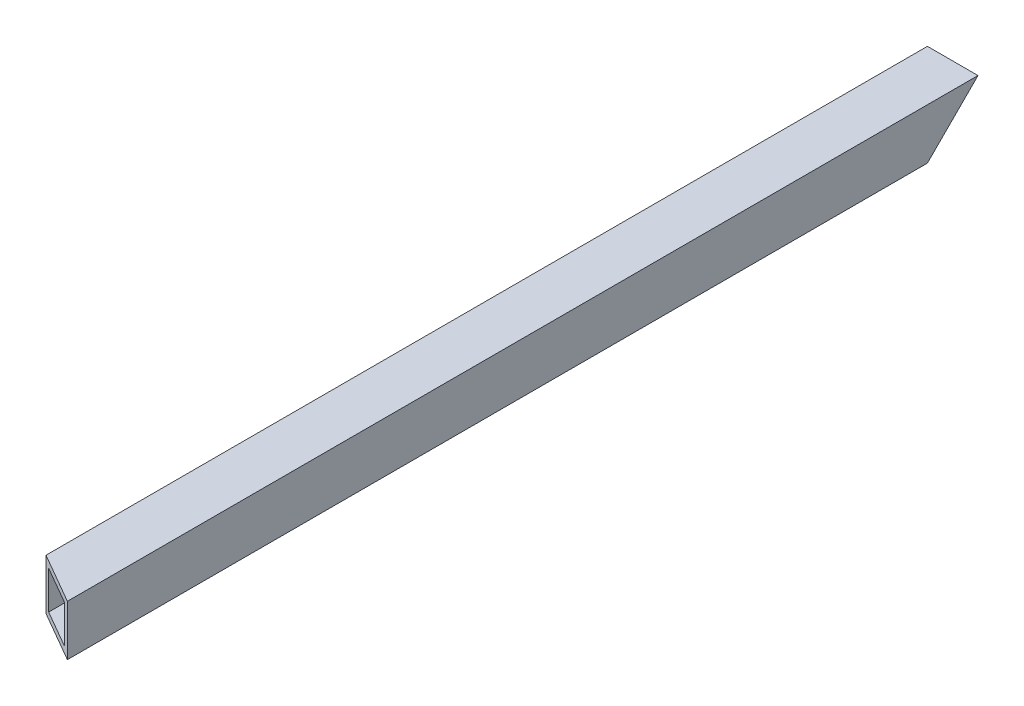
ISO-10303-21;
HEADER;
FILE_DESCRIPTION(('STEP AP214'),'2;1');
FILE_NAME('part.step','',(''),(''),'','','');
FILE_SCHEMA(('AUTOMOTIVE_DESIGN { 1 0 10303 214 1 1 1 1 }'));
ENDSEC;
DATA;
#1=APPLICATION_CONTEXT('core data for automotive mechanical design processes');
#2=APPLICATION_PROTOCOL_DEFINITION('international standard','automotive_design',2000,#1);
#3=PRODUCT_CONTEXT('',#1,'mechanical');
#4=PRODUCT('Part','Part','',(#3));
#5=PRODUCT_RELATED_PRODUCT_CATEGORY('part','',(#4));
#6=PRODUCT_DEFINITION_FORMATION('','',#4);
#7=PRODUCT_DEFINITION_CONTEXT('part definition',#1,'design');
#8=PRODUCT_DEFINITION('design','',#6,#7);
#9=PRODUCT_DEFINITION_SHAPE('','',#8);
#10=(LENGTH_UNIT() NAMED_UNIT(*) SI_UNIT(.MILLI.,.METRE.));
#11=(NAMED_UNIT(*) PLANE_ANGLE_UNIT() SI_UNIT($,.RADIAN.));
#12=(NAMED_UNIT(*) SI_UNIT($,.STERADIAN.) SOLID_ANGLE_UNIT());
#13=UNCERTAINTY_MEASURE_WITH_UNIT(LENGTH_MEASURE(1.E-05),#10,'distance_accuracy_value','');
#14=(GEOMETRIC_REPRESENTATION_CONTEXT(3) GLOBAL_UNCERTAINTY_ASSIGNED_CONTEXT((#13)) GLOBAL_UNIT_ASSIGNED_CONTEXT((#10,
#11,#12)) REPRESENTATION_CONTEXT('',''));
#15=CARTESIAN_POINT('',(0.,0.,0.));
#16=DIRECTION('',(0.,0.,1.));
#17=DIRECTION('',(1.,0.,0.));
#18=AXIS2_PLACEMENT_3D('',#15,#16,#17);
#19=CARTESIAN_POINT('',(-12.7,12.7,213.935303162583));
#20=DIRECTION('',(0.500000000000001,0.,-0.866025403784438));
#21=DIRECTION('',(-0.866025403784438,0.,-0.500000000000001));
#22=AXIS2_PLACEMENT_3D('',#19,#20,#21);
#23=PLANE('',#22);
#24=DIRECTION('',(0.866025403784438,0.,0.500000000000001));
#25=VECTOR('',#24,1.);
#26=CARTESIAN_POINT('',(-49.4933518262807,-12.7,192.692651581292));
#27=LINE('',#26,#25);
#28=CARTESIAN_POINT('',(-12.7,-12.7,213.935303162583));
#29=VERTEX_POINT('',#28);
#30=CARTESIAN_POINT('',(12.7,-12.7,228.6));
#31=VERTEX_POINT('',#30);
#32=EDGE_CURVE('E10',#29,#31,#27,.T.);
#33=ORIENTED_EDGE('',*,*,#32,.T.);
#34=DIRECTION('',(0.,1.,0.));
#35=VECTOR('',#34,1.);
#36=CARTESIAN_POINT('',(12.7,12.7,228.6));
#37=LINE('',#36,#35);
#38=CARTESIAN_POINT('',(12.7,12.7,228.6));
#39=VERTEX_POINT('',#38);
#40=EDGE_CURVE('E26',#31,#39,#37,.T.);
#41=ORIENTED_EDGE('',*,*,#40,.T.);
#42=DIRECTION('',(-0.866025403784438,0.,-0.500000000000001));
#43=VECTOR('',#42,1.);
#44=CARTESIAN_POINT('',(-59.0183518262807,12.7,187.193390267261));
#45=LINE('',#44,#43);
#46=CARTESIAN_POINT('',(-12.7,12.7,213.935303162583));
#47=VERTEX_POINT('',#46);
#48=EDGE_CURVE('E144',#39,#47,#45,.T.);
#49=ORIENTED_EDGE('',*,*,#48,.T.);
#50=DIRECTION('',(0.,-1.,0.));
#51=VECTOR('',#50,1.);
#52=CARTESIAN_POINT('',(-12.7,0.,213.935303162584));
#53=LINE('',#52,#51);
#54=EDGE_CURVE('E141',#47,#29,#53,.T.);
#55=ORIENTED_EDGE('',*,*,#54,.T.);
#56=EDGE_LOOP('',(#33,#41,#49,#55));
#57=FACE_BOUND('',#56,.T.);
#58=DIRECTION('',(0.,1.,0.));
#59=VECTOR('',#58,1.);
#60=CARTESIAN_POINT('',(-9.52500000000001,1.5875,215.768390267261));
#61=LINE('',#60,#59);
#62=CARTESIAN_POINT('',(-9.525,-9.525,215.768390267261));
#63=VERTEX_POINT('',#62);
#64=CARTESIAN_POINT('',(-9.525,9.525,215.768390267261));
#65=VERTEX_POINT('',#64);
#66=EDGE_CURVE('E139',#63,#65,#61,.T.);
#67=ORIENTED_EDGE('',*,*,#66,.T.);
#68=DIRECTION('',(0.866025403784438,0.,0.500000000000001));
#69=VECTOR('',#68,1.);
#70=CARTESIAN_POINT('',(-57.8277268262807,9.525,187.880797931514));
#71=LINE('',#70,#69);
#72=CARTESIAN_POINT('',(9.525,9.525,226.766912895323));
#73=VERTEX_POINT('',#72);
#74=EDGE_CURVE('E105',#65,#73,#71,.T.);
#75=ORIENTED_EDGE('',*,*,#74,.T.);
#76=DIRECTION('',(0.,-1.,0.));
#77=VECTOR('',#76,1.);
#78=CARTESIAN_POINT('',(9.52500000000001,11.1125,226.766912895323));
#79=LINE('',#78,#77);
#80=CARTESIAN_POINT('',(9.525,-9.525,226.766912895323));
#81=VERTEX_POINT('',#80);
#82=EDGE_CURVE('E135',#73,#81,#79,.T.);
#83=ORIENTED_EDGE('',*,*,#82,.T.);
#84=DIRECTION('',(-0.866025403784438,0.,-0.500000000000001));
#85=VECTOR('',#84,1.);
#86=CARTESIAN_POINT('',(-50.6839768262807,-9.525,192.005243917038));
#87=LINE('',#86,#85);
#88=EDGE_CURVE('E132',#81,#63,#87,.T.);
#89=ORIENTED_EDGE('',*,*,#88,.T.);
#90=EDGE_LOOP('',(#67,#75,#83,#89));
#91=FACE_BOUND('',#90,.T.);
#92=ADVANCED_FACE('F16',(#57,#91),#23,.F.);
#93=CARTESIAN_POINT('',(9.525,9.525,0.));
#94=DIRECTION('',(1.,0.,0.));
#95=DIRECTION('',(0.,0.,-1.));
#96=AXIS2_PLACEMENT_3D('',#93,#94,#95);
#97=PLANE('',#96);
#98=ORIENTED_EDGE('',*,*,#82,.F.);
#99=DIRECTION('',(0.,0.,1.));
#100=VECTOR('',#99,1.);
#101=CARTESIAN_POINT('',(9.525,9.525,0.));
#102=LINE('',#101,#100);
#103=CARTESIAN_POINT('',(9.525,9.525,-225.425));
#104=VERTEX_POINT('',#103);
#105=EDGE_CURVE('E107',#104,#73,#102,.T.);
#106=ORIENTED_EDGE('',*,*,#105,.F.);
#107=DIRECTION('',(0.,0.707106781186548,-0.707106781186547));
#108=VECTOR('',#107,1.);
#109=CARTESIAN_POINT('',(9.525,-45.24375,-170.65625));
#110=LINE('',#109,#108);
#111=CARTESIAN_POINT('',(9.525,-9.525,-206.375));
#112=VERTEX_POINT('',#111);
#113=EDGE_CURVE('E99',#112,#104,#110,.T.);
#114=ORIENTED_EDGE('',*,*,#113,.F.);
#115=DIRECTION('',(0.,0.,-1.));
#116=VECTOR('',#115,1.);
#117=CARTESIAN_POINT('',(9.525,-9.525,0.));
#118=LINE('',#117,#116);
#119=EDGE_CURVE('E127',#81,#112,#118,.T.);
#120=ORIENTED_EDGE('',*,*,#119,.F.);
#121=EDGE_LOOP('',(#98,#106,#114,#120));
#122=FACE_BOUND('',#121,.T.);
#123=ADVANCED_FACE('F169',(#122),#97,.F.);
#124=CARTESIAN_POINT('',(9.525,-9.525,0.));
#125=DIRECTION('',(0.,-1.,0.));
#126=DIRECTION('',(0.,0.,-1.));
#127=AXIS2_PLACEMENT_3D('',#124,#125,#126);
#128=PLANE('',#127);
#129=ORIENTED_EDGE('',*,*,#88,.F.);
#130=ORIENTED_EDGE('',*,*,#119,.T.);
#131=DIRECTION('',(1.,0.,0.));
#132=VECTOR('',#131,1.);
#133=CARTESIAN_POINT('',(-1.5875,-9.52500000000001,-206.375));
#134=LINE('',#133,#132);
#135=CARTESIAN_POINT('',(-9.525,-9.525,-206.375));
#136=VERTEX_POINT('',#135);
#137=EDGE_CURVE('E95',#136,#112,#134,.T.);
#138=ORIENTED_EDGE('',*,*,#137,.F.);
#139=DIRECTION('',(0.,0.,-1.));
#140=VECTOR('',#139,1.);
#141=CARTESIAN_POINT('',(-9.525,-9.525,0.));
#142=LINE('',#141,#140);
#143=EDGE_CURVE('E90',#63,#136,#142,.T.);
#144=ORIENTED_EDGE('',*,*,#143,.F.);
#145=EDGE_LOOP('',(#129,#130,#138,#144));
#146=FACE_BOUND('',#145,.T.);
#147=ADVANCED_FACE('F173',(#146),#128,.F.);
#148=CARTESIAN_POINT('',(-12.7,-12.7,0.));
#149=DIRECTION('',(-1.,0.,0.));
#150=DIRECTION('',(0.,0.,1.));
#151=AXIS2_PLACEMENT_3D('',#148,#149,#150);
#152=PLANE('',#151);
#153=ORIENTED_EDGE('',*,*,#54,.F.);
#154=DIRECTION('',(0.,0.,-1.));
#155=VECTOR('',#154,1.);
#156=CARTESIAN_POINT('',(-12.7,12.7,0.));
#157=LINE('',#156,#155);
#158=CARTESIAN_POINT('',(-12.7,12.7,-228.6));
#159=VERTEX_POINT('',#158);
#160=EDGE_CURVE('E124',#47,#159,#157,.T.);
#161=ORIENTED_EDGE('',*,*,#160,.T.);
#162=DIRECTION('',(0.,0.707106781186548,-0.707106781186547));
#163=VECTOR('',#162,1.);
#164=CARTESIAN_POINT('',(-12.7,-50.8,-165.1));
#165=LINE('',#164,#163);
#166=CARTESIAN_POINT('',(-12.7,-12.7,-203.2));
#167=VERTEX_POINT('',#166);
#168=EDGE_CURVE('E112',#167,#159,#165,.T.);
#169=ORIENTED_EDGE('',*,*,#168,.F.);
#170=DIRECTION('',(0.,0.,1.));
#171=VECTOR('',#170,1.);
#172=CARTESIAN_POINT('',(-12.7,-12.7,0.));
#173=LINE('',#172,#171);
#174=EDGE_CURVE('E119',#167,#29,#173,.T.);
#175=ORIENTED_EDGE('',*,*,#174,.T.);
#176=EDGE_LOOP('',(#153,#161,#169,#175));
#177=FACE_BOUND('',#176,.T.);
#178=ADVANCED_FACE('F156',(#177),#152,.T.);
#179=CARTESIAN_POINT('',(12.7,-12.7,0.));
#180=DIRECTION('',(0.,-1.,0.));
#181=DIRECTION('',(0.,0.,-1.));
#182=AXIS2_PLACEMENT_3D('',#179,#180,#181);
#183=PLANE('',#182);
#184=ORIENTED_EDGE('',*,*,#32,.F.);
#185=ORIENTED_EDGE('',*,*,#174,.F.);
#186=DIRECTION('',(-1.,0.,0.));
#187=VECTOR('',#186,1.);
#188=CARTESIAN_POINT('',(0.,-12.7,-203.2));
#189=LINE('',#188,#187);
#190=CARTESIAN_POINT('',(12.7,-12.7,-203.2));
#191=VERTEX_POINT('',#190);
#192=EDGE_CURVE('E116',#191,#167,#189,.T.);
#193=ORIENTED_EDGE('',*,*,#192,.F.);
#194=DIRECTION('',(0.,0.,1.));
#195=VECTOR('',#194,1.);
#196=CARTESIAN_POINT('',(12.7,-12.7,0.));
#197=LINE('',#196,#195);
#198=EDGE_CURVE('E115',#191,#31,#197,.T.);
#199=ORIENTED_EDGE('',*,*,#198,.T.);
#200=EDGE_LOOP('',(#184,#185,#193,#199));
#201=FACE_BOUND('',#200,.T.);
#202=ADVANCED_FACE('F159',(#201),#183,.T.);
#203=CARTESIAN_POINT('',(-12.7,12.7,-228.6));
#204=DIRECTION('',(0.,0.707106781186547,0.707106781186548));
#205=DIRECTION('',(0.,-0.707106781186548,0.707106781186547));
#206=AXIS2_PLACEMENT_3D('',#203,#204,#205);
#207=PLANE('',#206);
#208=DIRECTION('',(0.,-0.707106781186548,0.707106781186547));
#209=VECTOR('',#208,1.);
#210=CARTESIAN_POINT('',(12.7,-44.45,-171.45));
#211=LINE('',#210,#209);
#212=CARTESIAN_POINT('',(12.7,12.7,-228.6));
#213=VERTEX_POINT('',#212);
#214=EDGE_CURVE('E113',#213,#191,#211,.T.);
#215=ORIENTED_EDGE('',*,*,#214,.T.);
#216=ORIENTED_EDGE('',*,*,#192,.T.);
#217=ORIENTED_EDGE('',*,*,#168,.T.);
#218=DIRECTION('',(1.,0.,0.));
#219=VECTOR('',#218,1.);
#220=CARTESIAN_POINT('',(-12.7,12.7,-228.6));
#221=LINE('',#220,#219);
#222=EDGE_CURVE('E77',#159,#213,#221,.T.);
#223=ORIENTED_EDGE('',*,*,#222,.T.);
#224=EDGE_LOOP('',(#215,#216,#217,#223));
#225=FACE_BOUND('',#224,.T.);
#226=ORIENTED_EDGE('',*,*,#113,.T.);
#227=DIRECTION('',(-1.,0.,0.));
#228=VECTOR('',#227,1.);
#229=CARTESIAN_POINT('',(-11.1125,9.52500000000001,-225.425));
#230=LINE('',#229,#228);
#231=CARTESIAN_POINT('',(-9.525,9.525,-225.425));
#232=VERTEX_POINT('',#231);
#233=EDGE_CURVE('E94',#104,#232,#230,.T.);
#234=ORIENTED_EDGE('',*,*,#233,.T.);
#235=DIRECTION('',(0.,-0.707106781186548,0.707106781186547));
#236=VECTOR('',#235,1.);
#237=CARTESIAN_POINT('',(-9.525,-50.00625,-165.89375));
#238=LINE('',#237,#236);
#239=EDGE_CURVE('E83',#232,#136,#238,.T.);
#240=ORIENTED_EDGE('',*,*,#239,.T.);
#241=ORIENTED_EDGE('',*,*,#137,.T.);
#242=EDGE_LOOP('',(#226,#234,#240,#241));
#243=FACE_BOUND('',#242,.T.);
#244=ADVANCED_FACE('F18',(#225,#243),#207,.F.);
#245=CARTESIAN_POINT('',(-9.525,-9.525,0.));
#246=DIRECTION('',(-1.,0.,0.));
#247=DIRECTION('',(0.,0.,1.));
#248=AXIS2_PLACEMENT_3D('',#245,#246,#247);
#249=PLANE('',#248);
#250=ORIENTED_EDGE('',*,*,#66,.F.);
#251=ORIENTED_EDGE('',*,*,#143,.T.);
#252=ORIENTED_EDGE('',*,*,#239,.F.);
#253=DIRECTION('',(0.,0.,-1.));
#254=VECTOR('',#253,1.);
#255=CARTESIAN_POINT('',(-9.525,9.525,0.));
#256=LINE('',#255,#254);
#257=EDGE_CURVE('E88',#65,#232,#256,.T.);
#258=ORIENTED_EDGE('',*,*,#257,.F.);
#259=EDGE_LOOP('',(#250,#251,#252,#258));
#260=FACE_BOUND('',#259,.T.);
#261=ADVANCED_FACE('F86',(#260),#249,.F.);
#262=CARTESIAN_POINT('',(-9.525,9.525,0.));
#263=DIRECTION('',(0.,1.,0.));
#264=DIRECTION('',(0.,0.,1.));
#265=AXIS2_PLACEMENT_3D('',#262,#263,#264);
#266=PLANE('',#265);
#267=ORIENTED_EDGE('',*,*,#74,.F.);
#268=ORIENTED_EDGE('',*,*,#257,.T.);
#269=ORIENTED_EDGE('',*,*,#233,.F.);
#270=ORIENTED_EDGE('',*,*,#105,.T.);
#271=EDGE_LOOP('',(#267,#268,#269,#270));
#272=FACE_BOUND('',#271,.T.);
#273=ADVANCED_FACE('F103',(#272),#266,.F.);
#274=CARTESIAN_POINT('',(12.7,12.7,0.));
#275=DIRECTION('',(1.,0.,0.));
#276=DIRECTION('',(0.,0.,-1.));
#277=AXIS2_PLACEMENT_3D('',#274,#275,#276);
#278=PLANE('',#277);
#279=ORIENTED_EDGE('',*,*,#214,.F.);
#280=DIRECTION('',(0.,0.,1.));
#281=VECTOR('',#280,1.);
#282=CARTESIAN_POINT('',(12.7,12.7,0.));
#283=LINE('',#282,#281);
#284=EDGE_CURVE('E20',#213,#39,#283,.T.);
#285=ORIENTED_EDGE('',*,*,#284,.T.);
#286=ORIENTED_EDGE('',*,*,#40,.F.);
#287=ORIENTED_EDGE('',*,*,#198,.F.);
#288=EDGE_LOOP('',(#279,#285,#286,#287));
#289=FACE_BOUND('',#288,.T.);
#290=ADVANCED_FACE('F152',(#289),#278,.T.);
#291=CARTESIAN_POINT('',(-12.7,12.7,0.));
#292=DIRECTION('',(0.,1.,0.));
#293=DIRECTION('',(0.,0.,1.));
#294=AXIS2_PLACEMENT_3D('',#291,#292,#293);
#295=PLANE('',#294);
#296=ORIENTED_EDGE('',*,*,#48,.F.);
#297=ORIENTED_EDGE('',*,*,#284,.F.);
#298=ORIENTED_EDGE('',*,*,#222,.F.);
#299=ORIENTED_EDGE('',*,*,#160,.F.);
#300=EDGE_LOOP('',(#296,#297,#298,#299));
#301=FACE_BOUND('',#300,.T.);
#302=ADVANCED_FACE('F154',(#301),#295,.T.);
#303=CLOSED_SHELL('',(#92,#123,#147,#178,#202,#244,#261,#273,#290,#302));
#304=MANIFOLD_SOLID_BREP('B1',#303);
#305=ADVANCED_BREP_SHAPE_REPRESENTATION('',(#18,#304),#14);
#306=SHAPE_DEFINITION_REPRESENTATION(#9,#305);
ENDSEC;
END-ISO-10303-21;
